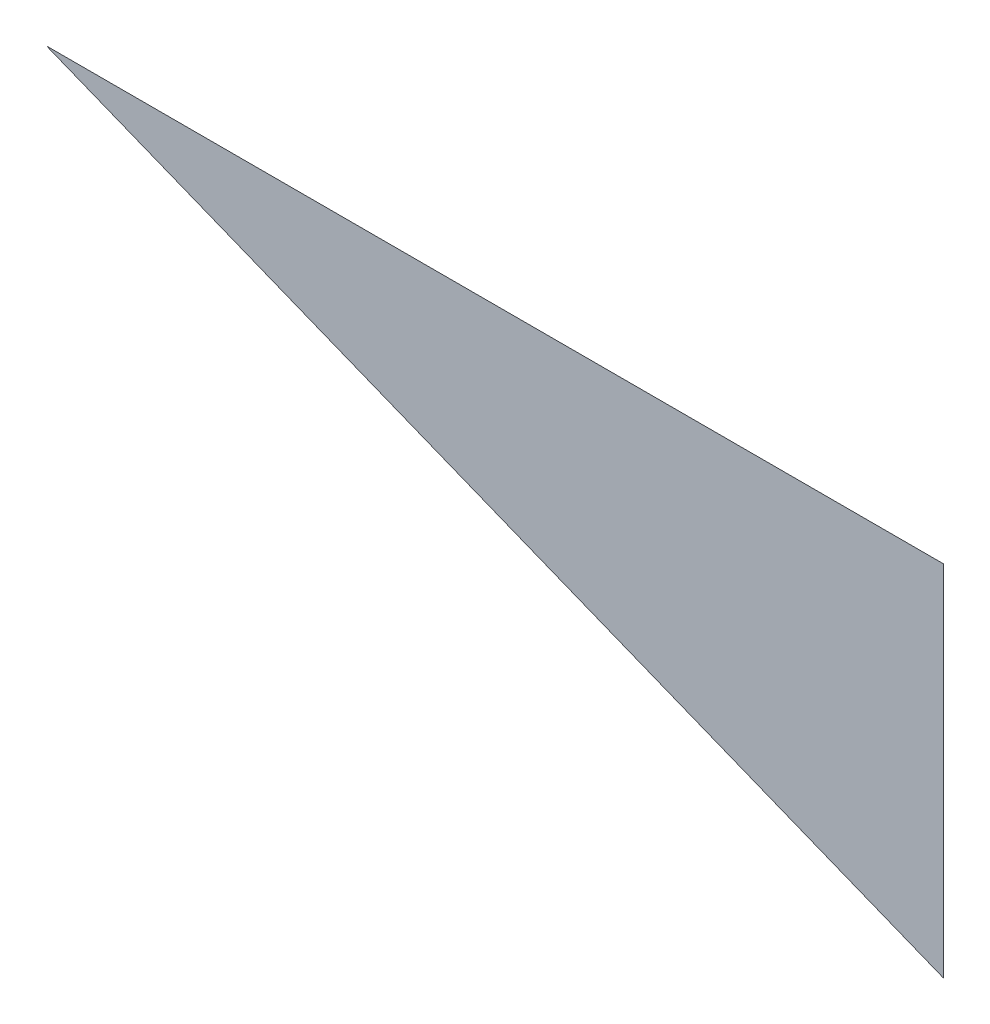
ISO-10303-21;
HEADER;
FILE_DESCRIPTION(('STEP AP214'),'2;1');
FILE_NAME('part.step','',(''),(''),'','','');
FILE_SCHEMA(('AUTOMOTIVE_DESIGN { 1 0 10303 214 1 1 1 1 }'));
ENDSEC;
DATA;
#1=APPLICATION_CONTEXT('core data for automotive mechanical design processes');
#2=APPLICATION_PROTOCOL_DEFINITION('international standard','automotive_design',2000,#1);
#3=PRODUCT_CONTEXT('',#1,'mechanical');
#4=PRODUCT('Part','Part','',(#3));
#5=PRODUCT_RELATED_PRODUCT_CATEGORY('part','',(#4));
#6=PRODUCT_DEFINITION_FORMATION('','',#4);
#7=PRODUCT_DEFINITION_CONTEXT('part definition',#1,'design');
#8=PRODUCT_DEFINITION('design','',#6,#7);
#9=PRODUCT_DEFINITION_SHAPE('','',#8);
#10=(LENGTH_UNIT() NAMED_UNIT(*) SI_UNIT(.MILLI.,.METRE.));
#11=(NAMED_UNIT(*) PLANE_ANGLE_UNIT() SI_UNIT($,.RADIAN.));
#12=(NAMED_UNIT(*) SI_UNIT($,.STERADIAN.) SOLID_ANGLE_UNIT());
#13=UNCERTAINTY_MEASURE_WITH_UNIT(LENGTH_MEASURE(1.E-05),#10,'distance_accuracy_value','');
#14=(GEOMETRIC_REPRESENTATION_CONTEXT(3) GLOBAL_UNCERTAINTY_ASSIGNED_CONTEXT((#13)) GLOBAL_UNIT_ASSIGNED_CONTEXT((#10,
#11,#12)) REPRESENTATION_CONTEXT('',''));
#15=CARTESIAN_POINT('',(0.,0.,0.));
#16=DIRECTION('',(0.,0.,1.));
#17=DIRECTION('',(1.,0.,0.));
#18=AXIS2_PLACEMENT_3D('',#15,#16,#17);
#19=CARTESIAN_POINT('',(0.,0.,0.));
#20=DIRECTION('',(0.,0.,1.));
#21=DIRECTION('',(1.,0.,0.));
#22=AXIS2_PLACEMENT_3D('',#19,#20,#21);
#23=PLANE('',#22);
#24=CARTESIAN_POINT('',(-0.125,0.0499999999999999,0.0001771235930937));
#25=DIRECTION('',(0.928476690885259,-0.371390676354104,0.));
#26=VECTOR('',#25,1.);
#27=LINE('',#24,#26);
#28=CARTESIAN_POINT('',(-0.125,0.0499999999999999,8.856179654685E-05));
#29=VERTEX_POINT('',#28);
#30=CARTESIAN_POINT('',(0.125,-0.0500000000000001,8.856179654685E-05));
#31=VERTEX_POINT('',#30);
#32=EDGE_CURVE('E11',#29,#31,#27,.T.);
#33=ORIENTED_EDGE('',*,*,#32,.F.);
#34=CARTESIAN_POINT('',(0.125,0.05,0.0001771235930937));
#35=DIRECTION('',(-1.,0.,0.));
#36=VECTOR('',#35,1.);
#37=LINE('',#34,#36);
#38=CARTESIAN_POINT('',(0.125,0.05,8.856179654685E-05));
#39=VERTEX_POINT('',#38);
#40=EDGE_CURVE('E28',#39,#29,#37,.T.);
#41=ORIENTED_EDGE('',*,*,#40,.F.);
#42=CARTESIAN_POINT('',(0.125,-0.05,0.0001771235930937));
#43=DIRECTION('',(0.,1.,0.));
#44=VECTOR('',#43,1.);
#45=LINE('',#42,#44);
#46=EDGE_CURVE('E39',#31,#39,#45,.T.);
#47=ORIENTED_EDGE('',*,*,#46,.F.);
#48=EDGE_LOOP('',(#33,#41,#47));
#49=FACE_BOUND('',#48,.T.);
#50=ADVANCED_FACE('F17',(#49),#23,.F.);
#51=CARTESIAN_POINT('',(0.,0.,0.0001771235930937));
#52=DIRECTION('',(0.,0.,1.));
#53=DIRECTION('',(1.,0.,0.));
#54=AXIS2_PLACEMENT_3D('',#51,#52,#53);
#55=PLANE('',#54);
#56=ORIENTED_EDGE('',*,*,#40,.T.);
#57=ORIENTED_EDGE('',*,*,#32,.T.);
#58=ORIENTED_EDGE('',*,*,#46,.T.);
#59=EDGE_LOOP('',(#56,#57,#58));
#60=FACE_BOUND('',#59,.T.);
#61=ADVANCED_FACE('F44',(#60),#55,.T.);
#62=CLOSED_SHELL('',(#50,#61));
#63=MANIFOLD_SOLID_BREP('B1',#62);
#64=ADVANCED_BREP_SHAPE_REPRESENTATION('',(#18,#63),#14);
#65=SHAPE_DEFINITION_REPRESENTATION(#9,#64);
ENDSEC;
END-ISO-10303-21;
